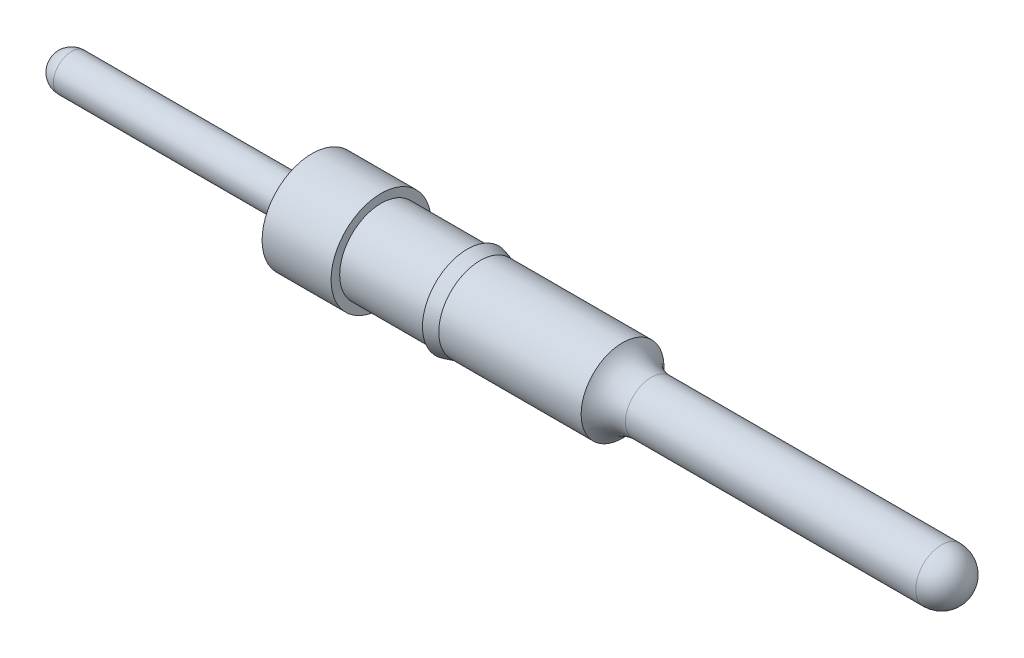
ISO-10303-21;
HEADER;
FILE_DESCRIPTION(('STEP AP214'),'2;1');
FILE_NAME('part.step','',(''),(''),'','','');
FILE_SCHEMA(('AUTOMOTIVE_DESIGN { 1 0 10303 214 1 1 1 1 }'));
ENDSEC;
DATA;
#1=APPLICATION_CONTEXT('core data for automotive mechanical design processes');
#2=APPLICATION_PROTOCOL_DEFINITION('international standard','automotive_design',2000,#1);
#3=PRODUCT_CONTEXT('',#1,'mechanical');
#4=PRODUCT('Part','Part','',(#3));
#5=PRODUCT_RELATED_PRODUCT_CATEGORY('part','',(#4));
#6=PRODUCT_DEFINITION_FORMATION('','',#4);
#7=PRODUCT_DEFINITION_CONTEXT('part definition',#1,'design');
#8=PRODUCT_DEFINITION('design','',#6,#7);
#9=PRODUCT_DEFINITION_SHAPE('','',#8);
#10=(LENGTH_UNIT() NAMED_UNIT(*) SI_UNIT(.MILLI.,.METRE.));
#11=(NAMED_UNIT(*) PLANE_ANGLE_UNIT() SI_UNIT($,.RADIAN.));
#12=(NAMED_UNIT(*) SI_UNIT($,.STERADIAN.) SOLID_ANGLE_UNIT());
#13=UNCERTAINTY_MEASURE_WITH_UNIT(LENGTH_MEASURE(1.E-05),#10,'distance_accuracy_value','');
#14=(GEOMETRIC_REPRESENTATION_CONTEXT(3) GLOBAL_UNCERTAINTY_ASSIGNED_CONTEXT((#13)) GLOBAL_UNIT_ASSIGNED_CONTEXT((#10,
#11,#12)) REPRESENTATION_CONTEXT('',''));
#15=CARTESIAN_POINT('',(0.,0.,0.));
#16=DIRECTION('',(0.,0.,1.));
#17=DIRECTION('',(1.,0.,0.));
#18=AXIS2_PLACEMENT_3D('',#15,#16,#17);
#19=CARTESIAN_POINT('',(0.13335,0.,0.));
#20=DIRECTION('',(-1.,0.,0.));
#21=DIRECTION('',(0.,1.,0.));
#22=AXIS2_PLACEMENT_3D('',#19,#20,#21);
#23=SPHERICAL_SURFACE('',#22,0.13335);
#24=CARTESIAN_POINT('',(0.13335,0.,0.));
#25=DIRECTION('',(-1.,0.,0.));
#26=DIRECTION('',(0.,0.,1.));
#27=AXIS2_PLACEMENT_3D('',#24,#25,#26);
#28=CIRCLE('',#27,0.13335);
#29=CARTESIAN_POINT('',(0.13335,0.,0.13335));
#30=VERTEX_POINT('',#29);
#31=EDGE_CURVE('E54',#30,#30,#28,.T.);
#32=ORIENTED_EDGE('',*,*,#31,.T.);
#33=EDGE_LOOP('',(#32));
#34=FACE_BOUND('',#33,.T.);
#35=ADVANCED_FACE('F14',(#34),#23,.T.);
#36=CARTESIAN_POINT('',(6.5405,0.,0.));
#37=DIRECTION('',(-1.,0.,0.));
#38=DIRECTION('',(0.,1.,0.));
#39=AXIS2_PLACEMENT_3D('',#36,#37,#38);
#40=SPHERICAL_SURFACE('',#39,0.1905);
#41=CARTESIAN_POINT('',(6.5405,0.,0.));
#42=DIRECTION('',(-1.,0.,0.));
#43=DIRECTION('',(0.,0.,1.));
#44=AXIS2_PLACEMENT_3D('',#41,#42,#43);
#45=CIRCLE('',#44,0.1905);
#46=CARTESIAN_POINT('',(6.5405,0.,0.1905));
#47=VERTEX_POINT('',#46);
#48=EDGE_CURVE('E10',#47,#47,#45,.T.);
#49=ORIENTED_EDGE('',*,*,#48,.F.);
#50=EDGE_LOOP('',(#49));
#51=FACE_BOUND('',#50,.T.);
#52=ADVANCED_FACE('F121',(#51),#40,.T.);
#53=CARTESIAN_POINT('',(0.,0.,0.));
#54=DIRECTION('',(-1.,0.,0.));
#55=DIRECTION('',(0.,0.,1.));
#56=AXIS2_PLACEMENT_3D('',#53,#54,#55);
#57=CYLINDRICAL_SURFACE('',#56,0.1905);
#58=CARTESIAN_POINT('',(4.40313182222382,0.,0.));
#59=DIRECTION('',(-1.,0.,0.));
#60=DIRECTION('',(0.,0.,1.));
#61=AXIS2_PLACEMENT_3D('',#58,#59,#60);
#62=CIRCLE('',#61,0.1905);
#63=CARTESIAN_POINT('',(4.40313182222382,0.,0.1905));
#64=VERTEX_POINT('',#63);
#65=EDGE_CURVE('E20',#64,#64,#62,.T.);
#66=ORIENTED_EDGE('',*,*,#65,.F.);
#67=EDGE_LOOP('',(#66));
#68=FACE_BOUND('',#67,.T.);
#69=ORIENTED_EDGE('',*,*,#48,.T.);
#70=EDGE_LOOP('',(#69));
#71=FACE_BOUND('',#70,.T.);
#72=ADVANCED_FACE('F115',(#68,#71),#57,.T.);
#73=CARTESIAN_POINT('',(4.40313182222382,0.,0.));
#74=DIRECTION('',(-1.,0.,0.));
#75=DIRECTION('',(0.,0.,1.));
#76=AXIS2_PLACEMENT_3D('',#73,#74,#75);
#77=TOROIDAL_SURFACE('',#76,0.4445,0.254);
#78=CARTESIAN_POINT('',(4.191,0.,0.));
#79=DIRECTION('',(-1.,0.,0.));
#80=DIRECTION('',(0.,0.,1.));
#81=AXIS2_PLACEMENT_3D('',#78,#79,#80);
#82=CIRCLE('',#81,0.3048);
#83=CARTESIAN_POINT('',(4.191,0.,0.3048));
#84=VERTEX_POINT('',#83);
#85=EDGE_CURVE('E24',#84,#84,#82,.T.);
#86=ORIENTED_EDGE('',*,*,#85,.F.);
#87=EDGE_LOOP('',(#86));
#88=FACE_BOUND('',#87,.T.);
#89=ORIENTED_EDGE('',*,*,#65,.T.);
#90=EDGE_LOOP('',(#89));
#91=FACE_BOUND('',#90,.T.);
#92=ADVANCED_FACE('F110',(#88,#91),#77,.F.);
#93=CARTESIAN_POINT('',(0.,0.,0.));
#94=DIRECTION('',(-1.,0.,0.));
#95=DIRECTION('',(0.,0.,1.));
#96=AXIS2_PLACEMENT_3D('',#93,#94,#95);
#97=CYLINDRICAL_SURFACE('',#96,0.3048);
#98=CARTESIAN_POINT('',(3.14279409051228,0.,0.));
#99=DIRECTION('',(-1.,0.,0.));
#100=DIRECTION('',(0.,0.,1.));
#101=AXIS2_PLACEMENT_3D('',#98,#99,#100);
#102=CIRCLE('',#101,0.3048);
#103=CARTESIAN_POINT('',(3.14279409051228,0.,0.3048));
#104=VERTEX_POINT('',#103);
#105=EDGE_CURVE('E28',#104,#104,#102,.T.);
#106=ORIENTED_EDGE('',*,*,#105,.F.);
#107=EDGE_LOOP('',(#106));
#108=FACE_BOUND('',#107,.T.);
#109=ORIENTED_EDGE('',*,*,#85,.T.);
#110=EDGE_LOOP('',(#109));
#111=FACE_BOUND('',#110,.T.);
#112=ADVANCED_FACE('F104',(#108,#111),#97,.T.);
#113=CARTESIAN_POINT('',(3.14279409051228,0.,0.));
#114=DIRECTION('',(-1.,0.,0.));
#115=DIRECTION('',(0.,0.,1.));
#116=AXIS2_PLACEMENT_3D('',#113,#114,#115);
#117=CONICAL_SURFACE('',#116,0.3048,0.261799387799063);
#118=CARTESIAN_POINT('',(3.048,0.,0.));
#119=DIRECTION('',(-1.,0.,0.));
#120=DIRECTION('',(0.,0.,1.));
#121=AXIS2_PLACEMENT_3D('',#118,#119,#120);
#122=CIRCLE('',#121,0.3302);
#123=CARTESIAN_POINT('',(3.048,0.,0.3302));
#124=VERTEX_POINT('',#123);
#125=EDGE_CURVE('E33',#124,#124,#122,.T.);
#126=ORIENTED_EDGE('',*,*,#125,.F.);
#127=EDGE_LOOP('',(#126));
#128=FACE_BOUND('',#127,.T.);
#129=ORIENTED_EDGE('',*,*,#105,.T.);
#130=EDGE_LOOP('',(#129));
#131=FACE_BOUND('',#130,.T.);
#132=ADVANCED_FACE('F98',(#128,#131),#117,.T.);
#133=CARTESIAN_POINT('',(3.048,0.3048,0.));
#134=DIRECTION('',(1.,0.,0.));
#135=DIRECTION('',(0.,0.,-1.));
#136=AXIS2_PLACEMENT_3D('',#133,#134,#135);
#137=PLANE('',#136);
#138=CARTESIAN_POINT('',(3.048,0.,0.));
#139=DIRECTION('',(-1.,0.,0.));
#140=DIRECTION('',(0.,0.,1.));
#141=AXIS2_PLACEMENT_3D('',#138,#139,#140);
#142=CIRCLE('',#141,0.3048);
#143=CARTESIAN_POINT('',(3.048,0.,0.3048));
#144=VERTEX_POINT('',#143);
#145=EDGE_CURVE('E36',#144,#144,#142,.T.);
#146=ORIENTED_EDGE('',*,*,#145,.F.);
#147=EDGE_LOOP('',(#146));
#148=FACE_BOUND('',#147,.T.);
#149=ORIENTED_EDGE('',*,*,#125,.T.);
#150=EDGE_LOOP('',(#149));
#151=FACE_BOUND('',#150,.T.);
#152=ADVANCED_FACE('F92',(#148,#151),#137,.F.);
#153=CARTESIAN_POINT('',(0.,0.,0.));
#154=DIRECTION('',(-1.,0.,0.));
#155=DIRECTION('',(0.,0.,1.));
#156=AXIS2_PLACEMENT_3D('',#153,#154,#155);
#157=CYLINDRICAL_SURFACE('',#156,0.3048);
#158=CARTESIAN_POINT('',(2.413,0.,0.));
#159=DIRECTION('',(-1.,0.,0.));
#160=DIRECTION('',(0.,0.,1.));
#161=AXIS2_PLACEMENT_3D('',#158,#159,#160);
#162=CIRCLE('',#161,0.3048);
#163=CARTESIAN_POINT('',(2.413,0.,0.3048));
#164=VERTEX_POINT('',#163);
#165=EDGE_CURVE('E39',#164,#164,#162,.T.);
#166=ORIENTED_EDGE('',*,*,#165,.F.);
#167=EDGE_LOOP('',(#166));
#168=FACE_BOUND('',#167,.T.);
#169=ORIENTED_EDGE('',*,*,#145,.T.);
#170=EDGE_LOOP('',(#169));
#171=FACE_BOUND('',#170,.T.);
#172=ADVANCED_FACE('F86',(#168,#171),#157,.T.);
#173=CARTESIAN_POINT('',(2.413,0.3683,0.));
#174=DIRECTION('',(-1.,0.,0.));
#175=DIRECTION('',(0.,0.,1.));
#176=AXIS2_PLACEMENT_3D('',#173,#174,#175);
#177=PLANE('',#176);
#178=CARTESIAN_POINT('',(2.413,0.,0.));
#179=DIRECTION('',(-1.,0.,0.));
#180=DIRECTION('',(0.,0.,1.));
#181=AXIS2_PLACEMENT_3D('',#178,#179,#180);
#182=CIRCLE('',#181,0.3683);
#183=CARTESIAN_POINT('',(2.413,0.,0.3683));
#184=VERTEX_POINT('',#183);
#185=EDGE_CURVE('E42',#184,#184,#182,.T.);
#186=ORIENTED_EDGE('',*,*,#185,.F.);
#187=EDGE_LOOP('',(#186));
#188=FACE_BOUND('',#187,.T.);
#189=ORIENTED_EDGE('',*,*,#165,.T.);
#190=EDGE_LOOP('',(#189));
#191=FACE_BOUND('',#190,.T.);
#192=ADVANCED_FACE('F80',(#188,#191),#177,.F.);
#193=CARTESIAN_POINT('',(0.,0.,0.));
#194=DIRECTION('',(-1.,0.,0.));
#195=DIRECTION('',(0.,0.,1.));
#196=AXIS2_PLACEMENT_3D('',#193,#194,#195);
#197=CYLINDRICAL_SURFACE('',#196,0.3683);
#198=CARTESIAN_POINT('',(1.905,0.,0.));
#199=DIRECTION('',(-1.,0.,0.));
#200=DIRECTION('',(0.,0.,1.));
#201=AXIS2_PLACEMENT_3D('',#198,#199,#200);
#202=CIRCLE('',#201,0.3683);
#203=CARTESIAN_POINT('',(1.905,0.,0.3683));
#204=VERTEX_POINT('',#203);
#205=EDGE_CURVE('E45',#204,#204,#202,.T.);
#206=ORIENTED_EDGE('',*,*,#205,.F.);
#207=EDGE_LOOP('',(#206));
#208=FACE_BOUND('',#207,.T.);
#209=ORIENTED_EDGE('',*,*,#185,.T.);
#210=EDGE_LOOP('',(#209));
#211=FACE_BOUND('',#210,.T.);
#212=ADVANCED_FACE('F74',(#208,#211),#197,.T.);
#213=CARTESIAN_POINT('',(1.905,0.209549999999999,0.));
#214=DIRECTION('',(1.,0.,0.));
#215=DIRECTION('',(0.,0.,-1.));
#216=AXIS2_PLACEMENT_3D('',#213,#214,#215);
#217=PLANE('',#216);
#218=CARTESIAN_POINT('',(1.905,0.,0.));
#219=DIRECTION('',(-1.,0.,0.));
#220=DIRECTION('',(0.,0.,1.));
#221=AXIS2_PLACEMENT_3D('',#218,#219,#220);
#222=CIRCLE('',#221,0.209549999999999);
#223=CARTESIAN_POINT('',(1.905,0.,0.209549999999999));
#224=VERTEX_POINT('',#223);
#225=EDGE_CURVE('E48',#224,#224,#222,.T.);
#226=ORIENTED_EDGE('',*,*,#225,.F.);
#227=EDGE_LOOP('',(#226));
#228=FACE_BOUND('',#227,.T.);
#229=ORIENTED_EDGE('',*,*,#205,.T.);
#230=EDGE_LOOP('',(#229));
#231=FACE_BOUND('',#230,.T.);
#232=ADVANCED_FACE('F68',(#228,#231),#217,.F.);
#233=CARTESIAN_POINT('',(1.8288,0.,0.));
#234=DIRECTION('',(-1.,0.,0.));
#235=DIRECTION('',(0.,0.,1.));
#236=AXIS2_PLACEMENT_3D('',#233,#234,#235);
#237=TOROIDAL_SURFACE('',#236,0.209549999999999,0.0761999999999985);
#238=CARTESIAN_POINT('',(1.8288,0.,0.));
#239=DIRECTION('',(-1.,0.,0.));
#240=DIRECTION('',(0.,0.,1.));
#241=AXIS2_PLACEMENT_3D('',#238,#239,#240);
#242=CIRCLE('',#241,0.13335);
#243=CARTESIAN_POINT('',(1.8288,0.,0.13335));
#244=VERTEX_POINT('',#243);
#245=EDGE_CURVE('E51',#244,#244,#242,.T.);
#246=ORIENTED_EDGE('',*,*,#245,.F.);
#247=EDGE_LOOP('',(#246));
#248=FACE_BOUND('',#247,.T.);
#249=ORIENTED_EDGE('',*,*,#225,.T.);
#250=EDGE_LOOP('',(#249));
#251=FACE_BOUND('',#250,.T.);
#252=ADVANCED_FACE('F62',(#248,#251),#237,.F.);
#253=CARTESIAN_POINT('',(0.,0.,0.));
#254=DIRECTION('',(-1.,0.,0.));
#255=DIRECTION('',(0.,0.,1.));
#256=AXIS2_PLACEMENT_3D('',#253,#254,#255);
#257=CYLINDRICAL_SURFACE('',#256,0.13335);
#258=ORIENTED_EDGE('',*,*,#31,.F.);
#259=EDGE_LOOP('',(#258));
#260=FACE_BOUND('',#259,.T.);
#261=ORIENTED_EDGE('',*,*,#245,.T.);
#262=EDGE_LOOP('',(#261));
#263=FACE_BOUND('',#262,.T.);
#264=ADVANCED_FACE('F59',(#260,#263),#257,.T.);
#265=CLOSED_SHELL('',(#35,#52,#72,#92,#112,#132,#152,#172,#192,#212,#232,#252,#264));
#266=MANIFOLD_SOLID_BREP('B1',#265);
#267=ADVANCED_BREP_SHAPE_REPRESENTATION('',(#18,#266),#14);
#268=SHAPE_DEFINITION_REPRESENTATION(#9,#267);
ENDSEC;
END-ISO-10303-21;
